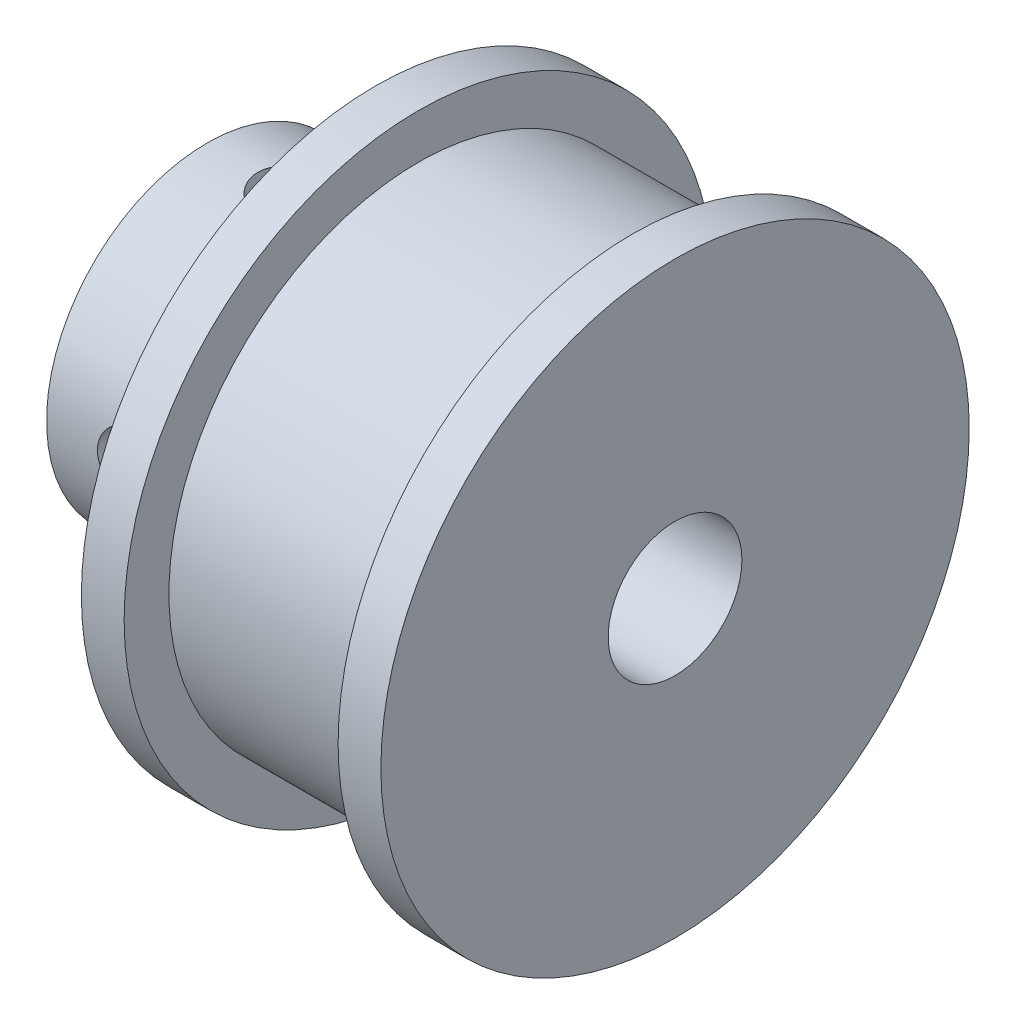
ISO-10303-21;
HEADER;
FILE_DESCRIPTION(('STEP AP214'),'2;1');
FILE_NAME('part.step','',(''),(''),'','','');
FILE_SCHEMA(('AUTOMOTIVE_DESIGN { 1 0 10303 214 1 1 1 1 }'));
ENDSEC;
DATA;
#1=APPLICATION_CONTEXT('core data for automotive mechanical design processes');
#2=APPLICATION_PROTOCOL_DEFINITION('international standard','automotive_design',2000,#1);
#3=PRODUCT_CONTEXT('',#1,'mechanical');
#4=PRODUCT('Part','Part','',(#3));
#5=PRODUCT_RELATED_PRODUCT_CATEGORY('part','',(#4));
#6=PRODUCT_DEFINITION_FORMATION('','',#4);
#7=PRODUCT_DEFINITION_CONTEXT('part definition',#1,'design');
#8=PRODUCT_DEFINITION('design','',#6,#7);
#9=PRODUCT_DEFINITION_SHAPE('','',#8);
#10=(LENGTH_UNIT() NAMED_UNIT(*) SI_UNIT(.MILLI.,.METRE.));
#11=(NAMED_UNIT(*) PLANE_ANGLE_UNIT() SI_UNIT($,.RADIAN.));
#12=(NAMED_UNIT(*) SI_UNIT($,.STERADIAN.) SOLID_ANGLE_UNIT());
#13=UNCERTAINTY_MEASURE_WITH_UNIT(LENGTH_MEASURE(1.E-05),#10,'distance_accuracy_value','');
#14=(GEOMETRIC_REPRESENTATION_CONTEXT(3) GLOBAL_UNCERTAINTY_ASSIGNED_CONTEXT((#13)) GLOBAL_UNIT_ASSIGNED_CONTEXT((#10,
#11,#12)) REPRESENTATION_CONTEXT('',''));
#15=CARTESIAN_POINT('',(0.,0.,0.));
#16=DIRECTION('',(0.,0.,1.));
#17=DIRECTION('',(1.,0.,0.));
#18=AXIS2_PLACEMENT_3D('',#15,#16,#17);
#19=CARTESIAN_POINT('',(0.,0.,0.));
#20=DIRECTION('',(1.,0.,0.));
#21=DIRECTION('',(0.,0.,-1.));
#22=AXIS2_PLACEMENT_3D('',#19,#20,#21);
#23=CYLINDRICAL_SURFACE('',#22,2.5);
#24=CARTESIAN_POINT('',(1.90000000000001,0.,2.5));
#25=CARTESIAN_POINT('',(1.90000412789938,0.0657149536912328,2.49999641755189));
#26=CARTESIAN_POINT('',(1.9052125914021,0.13150824962254,2.49738113774397));
#27=CARTESIAN_POINT('',(1.92581610042616,0.26115029408553,2.48717695046745));
#28=CARTESIAN_POINT('',(1.94123049124707,0.324995108391878,2.4795785978623));
#29=CARTESIAN_POINT('',(1.981492260771,0.448666931100716,2.4602034925414));
#30=CARTESIAN_POINT('',(2.00630298031002,0.508508503673972,2.448442989719));
#31=CARTESIAN_POINT('',(2.06446327670618,0.623090771008203,2.42182220644723));
#32=CARTESIAN_POINT('',(2.09781218031107,0.677831867487559,2.40696217041913));
#33=CARTESIAN_POINT('',(2.17439656185663,0.784384772202395,2.37445322822571));
#34=CARTESIAN_POINT('',(2.21810809904956,0.835819013902635,2.3566899890942));
#35=CARTESIAN_POINT('',(2.3131518490588,0.930974306083717,2.32074962808431));
#36=CARTESIAN_POINT('',(2.36448981471556,0.974689478883453,2.30257220261294));
#37=CARTESIAN_POINT('',(2.47810418690423,1.05656500056284,2.26623688996684));
#38=CARTESIAN_POINT('',(2.5409201229324,1.09403166943954,2.24818983712665));
#39=CARTESIAN_POINT('',(2.67295916998277,1.15771028361336,2.21607473465401));
#40=CARTESIAN_POINT('',(2.74217766090344,1.18393026870791,2.20200384508737));
#41=CARTESIAN_POINT('',(2.88083138177741,1.22266555273573,2.18072333797261));
#42=CARTESIAN_POINT('',(2.95000556508425,1.23590732135054,2.17315339479642));
#43=CARTESIAN_POINT('',(3.08997354722435,1.25053374163605,2.1647736243566));
#44=CARTESIAN_POINT('',(3.16076567608894,1.25193011046634,2.16395711679111));
#45=CARTESIAN_POINT('',(3.29285753039421,1.24335910896536,2.16888662821561));
#46=CARTESIAN_POINT('',(3.35428003902881,1.23473069942102,2.17385954577517));
#47=CARTESIAN_POINT('',(3.4746523867163,1.20867481132116,2.18845285917313));
#48=CARTESIAN_POINT('',(3.53360143163164,1.19124452987206,2.19807473539721));
#49=CARTESIAN_POINT('',(3.64903641570707,1.1477622254825,2.22109345515927));
#50=CARTESIAN_POINT('',(3.70543299848223,1.12151883389499,2.23457300829999));
#51=CARTESIAN_POINT('',(3.81329286573751,1.061302109585,2.26379255351755));
#52=CARTESIAN_POINT('',(3.86475391950011,1.02732530476558,2.27953355975239));
#53=CARTESIAN_POINT('',(3.96815156592903,0.947582568640978,2.31391447379108));
#54=CARTESIAN_POINT('',(4.01932109197019,0.900868072961595,2.33266887795933));
#55=CARTESIAN_POINT('',(4.11341927323862,0.799444473426711,2.36934529125509));
#56=CARTESIAN_POINT('',(4.15634399004235,0.744731570717851,2.38726689948501));
#57=CARTESIAN_POINT('',(4.23460707628715,0.625645632289805,2.42127484103705));
#58=CARTESIAN_POINT('',(4.26950059055717,0.560941989499256,2.43723730202509));
#59=CARTESIAN_POINT('',(4.32762128630376,0.425582769360992,2.46447351401553));
#60=CARTESIAN_POINT('',(4.35085773126895,0.354931970331592,2.47575098679441));
#61=CARTESIAN_POINT('',(4.38309425464584,0.215958114575874,2.49155417176795));
#62=CARTESIAN_POINT('',(4.39311404468347,0.147926913185403,2.4965617287664));
#63=CARTESIAN_POINT('',(4.40183091391811,0.0109744999366904,2.50091266823877));
#64=CARTESIAN_POINT('',(4.40053335704934,-0.0579462748373779,2.5002587340164));
#65=CARTESIAN_POINT('',(4.38724163947655,-0.189041214982493,2.49363990316801));
#66=CARTESIAN_POINT('',(4.37608433408746,-0.251324260062443,2.48809057110237));
#67=CARTESIAN_POINT('',(4.34470241013114,-0.373008615377396,2.47277714143524));
#68=CARTESIAN_POINT('',(4.32447679193329,-0.432409607113745,2.46301257917916));
#69=CARTESIAN_POINT('',(4.27500191695853,-0.54861076056208,2.43980314267087));
#70=CARTESIAN_POINT('',(4.24551118735398,-0.60528799625769,2.42626102212424));
#71=CARTESIAN_POINT('',(4.17861558044244,-0.713076702123649,2.39679967896386));
#72=CARTESIAN_POINT('',(4.1412073317582,-0.7641857872191,2.38087944457232));
#73=CARTESIAN_POINT('',(4.0552994683339,-0.864709611613313,2.34635276671831));
#74=CARTESIAN_POINT('',(4.00607141443304,-0.913465097280795,2.32763606060552));
#75=CARTESIAN_POINT('',(3.90009356091336,-1.00232040139155,2.29077989504843));
#76=CARTESIAN_POINT('',(3.84333860147953,-1.04241423211355,2.27264084226908));
#77=CARTESIAN_POINT('',(3.72044543224961,-1.11463489312211,2.23813990282585));
#78=CARTESIAN_POINT('',(3.65398591723925,-1.14628186984829,2.2219066207934));
#79=CARTESIAN_POINT('',(3.51561241538434,-1.19760353251725,2.19467590460158));
#80=CARTESIAN_POINT('',(3.44370559187351,-1.21729364485946,2.18367172800773));
#81=CARTESIAN_POINT('',(3.30386222142319,-1.24232710931209,2.16951876260834));
#82=CARTESIAN_POINT('',(3.2362071832137,-1.24886624550107,2.16571729325615));
#83=CARTESIAN_POINT('',(3.10069116603659,-1.25086144297598,2.16456693307719));
#84=CARTESIAN_POINT('',(3.03283028907571,-1.24632230828049,2.16721524534441));
#85=CARTESIAN_POINT('',(2.90564562308498,-1.22740765699032,2.17797327562531));
#86=CARTESIAN_POINT('',(2.8461244123195,-1.21401039292849,2.18553868102993));
#87=CARTESIAN_POINT('',(2.73023985071912,-1.1789691977808,2.20463770234897));
#88=CARTESIAN_POINT('',(2.67387752238504,-1.15732261394975,2.21617259462095));
#89=CARTESIAN_POINT('',(2.56171893626674,-1.10476968162585,2.24285662955661));
#90=CARTESIAN_POINT('',(2.50621512271288,-1.07333892227056,2.25819652995239));
#91=CARTESIAN_POINT('',(2.40090682977427,-1.00268871454578,2.29044164543238));
#92=CARTESIAN_POINT('',(2.35110533685189,-0.963465214048302,2.30734767243153));
#93=CARTESIAN_POINT('',(2.25232252205298,-0.872754158330794,2.34327903949142));
#94=CARTESIAN_POINT('',(2.2041761220476,-0.820355528762706,2.36231229139336));
#95=CARTESIAN_POINT('',(2.11717127072046,-0.707693507775342,2.3984719031886));
#96=CARTESIAN_POINT('',(2.07831782571714,-0.647425904070974,2.4155972326005));
#97=CARTESIAN_POINT('',(2.01095454654725,-0.519914496024927,2.44622511981379));
#98=CARTESIAN_POINT('',(1.98251978823571,-0.452624379918261,2.45970120703636));
#99=CARTESIAN_POINT('',(1.93773979010132,-0.313427626617733,2.48126676704332));
#100=CARTESIAN_POINT('',(1.92136019146304,-0.241534749528952,2.48937154216165));
#101=CARTESIAN_POINT('',(1.9076282361552,-0.140752433104225,2.49619327387079));
#102=CARTESIAN_POINT('',(1.90477169892048,-0.112702349299369,2.49761706674002));
#103=CARTESIAN_POINT('',(1.900956668104,-0.0564396647589448,2.49952121222331));
#104=CARTESIAN_POINT('',(1.89999822691101,-0.0282270595592256,2.50000153879704));
#105=CARTESIAN_POINT('',(1.90000000000001,0.,2.5));
#106=B_SPLINE_CURVE_WITH_KNOTS('',3,(#24,#25,#26,#27,#28,#29,#30,#31,#32,#33,#34,#35,#36,#37,
#38,#39,#40,#41,#42,#43,#44,#45,#46,#47,#48,#49,#50,#51,#52,#53,#54,#55,#56,#57,#58,#59,#60,#61,
#62,#63,#64,#65,#66,#67,#68,#69,#70,#71,#72,#73,#74,#75,#76,#77,#78,#79,#80,#81,#82,#83,#84,#85,
#86,#87,#88,#89,#90,#91,#92,#93,#94,#95,#96,#97,#98,#99,#100,#101,#102,#103,#104,#105),
.UNSPECIFIED.,.T.,.F.,(4,2,2,2,2,2,2,2,2,2,2,2,2,2,2,2,2,2,2,2,2,2,2,2,2,2,2,2,2,2,2,2,2,2,2,2,
2,2,2,2,4),(0.,0.197030321775365,0.394435187136495,0.59107769436537,0.787704700726955,
0.996227198397605,1.20490779706754,1.4297715803844,1.6544743487285,1.86572515175286,
2.07676696661274,2.26257140511649,2.44843504907097,2.63862800210608,2.82890651575276,
3.04331176667346,3.25781918248356,3.48228777768049,3.70657771140347,3.9122911308918,
4.11790705639343,4.3075863313265,4.49728652038662,4.6924107003487,4.88761813435421,
5.10199513305521,5.31651985769287,5.54143352699589,5.76605639925969,5.96911634372963,
6.17208824825003,6.35572412805224,6.53941910979594,6.73545570969514,6.93159451423693,
7.15156553440619,7.37165479220712,7.59330017078652,7.81431135781158,7.89894100172117,
7.98357298143554),.UNSPECIFIED.);
#107=CARTESIAN_POINT('',(1.90000000000001,0.,2.5));
#108=VERTEX_POINT('',#107);
#109=EDGE_CURVE('E3265',#108,#108,#106,.T.);
#110=ORIENTED_EDGE('',*,*,#109,.F.);
#111=EDGE_LOOP('',(#110));
#112=FACE_BOUND('',#111,.T.);
#113=CARTESIAN_POINT('',(3.15,2.1650635094611,-1.25));
#114=CARTESIAN_POINT('',(3.21513476024406,2.16506918410574,-1.24999545384316));
#115=CARTESIAN_POINT('',(3.28035176440631,2.16804751484696,-1.24487496341652));
#116=CARTESIAN_POINT('',(3.40878408084644,2.17952958065066,-1.22465401237257));
#117=CARTESIAN_POINT('',(3.47199489380426,2.18804492569449,-1.20953258069272));
#118=CARTESIAN_POINT('',(3.59431458042993,2.20936683256748,-1.17012493587476));
#119=CARTESIAN_POINT('',(3.65344331559198,2.22215054341565,-1.14588744061716));
#120=CARTESIAN_POINT('',(3.7667802524959,2.25053331021072,-1.08908440672046));
#121=CARTESIAN_POINT('',(3.82098818782807,2.26613251845081,-1.05651841754472));
#122=CARTESIAN_POINT('',(3.92788216069688,2.29996086321802,-0.980833175663597));
#123=CARTESIAN_POINT('',(3.98007391959193,2.31830079547442,-0.937065045179712));
#124=CARTESIAN_POINT('',(4.07676048550839,2.35464978482132,-0.841567259518084));
#125=CARTESIAN_POINT('',(4.1212514532294,2.37265867289062,-0.789833657227865));
#126=CARTESIAN_POINT('',(4.20420893893458,2.40776846191186,-0.675611954268182));
#127=CARTESIAN_POINT('',(4.24206720982441,2.42472633022716,-0.612633986265718));
#128=CARTESIAN_POINT('',(4.3064260665572,2.45438445124411,-0.480196283249379));
#129=CARTESIAN_POINT('',(4.33293382017146,2.46708738979677,-0.410740672672693));
#130=CARTESIAN_POINT('',(4.37188082662637,2.48600576555297,-0.272556179907471));
#131=CARTESIAN_POINT('',(4.38518690794442,2.49261850276115,-0.204127238111022));
#132=CARTESIAN_POINT('',(4.4002076483438,2.50009479807584,-0.0657132858723104));
#133=CARTESIAN_POINT('',(4.40192932099464,2.50096183480737,0.00427075730467285));
#134=CARTESIAN_POINT('',(4.39406665753706,2.49703727395563,0.137290655529687));
#135=CARTESIAN_POINT('',(4.38545248059847,2.49273119865201,0.200401498970989));
#136=CARTESIAN_POINT('',(4.35889894511918,2.47967806574684,0.324142214897902));
#137=CARTESIAN_POINT('',(4.34095888877972,2.47093067582992,0.384771901367406));
#138=CARTESIAN_POINT('',(4.29614679238773,2.44964479109568,0.502886739461941));
#139=CARTESIAN_POINT('',(4.26915460853492,2.43705551911499,0.560316779393972));
#140=CARTESIAN_POINT('',(4.20717072974813,2.40922057483359,0.66997100189166));
#141=CARTESIAN_POINT('',(4.17217617087206,2.39397395196855,0.722193311048306));
#142=CARTESIAN_POINT('',(4.09138081058373,2.36055492999037,0.825217076122743));
#143=CARTESIAN_POINT('',(4.04487121459249,2.34224219997719,0.8754175937867));
#144=CARTESIAN_POINT('',(3.94426284383728,2.30567925733515,0.967630462872224));
#145=CARTESIAN_POINT('',(3.89015828465742,2.28742910332036,1.00963651446779));
#146=CARTESIAN_POINT('',(3.77168975946989,2.25180195115606,1.08688166830276));
#147=CARTESIAN_POINT('',(3.70689247118224,2.23455399988385,1.12152164372256));
#148=CARTESIAN_POINT('',(3.57132791080125,2.2046931284822,1.17914889125154));
#149=CARTESIAN_POINT('',(3.50056695872805,2.19207537557584,1.20214832276361));
#150=CARTESIAN_POINT('',(3.36098186089651,2.17430794771293,1.2339752637813));
#151=CARTESIAN_POINT('',(3.29244860119556,2.16864569810621,1.24378140264997));
#152=CARTESIAN_POINT('',(3.15449832310432,2.16397399202012,1.25189618326428));
#153=CARTESIAN_POINT('',(3.08508196360027,2.1649598361164,1.25021294664378));
#154=CARTESIAN_POINT('',(2.95543260177659,2.17292920675731,1.23629505417996));
#155=CARTESIAN_POINT('',(2.89502568611509,2.17924484383318,1.22523477089058));
#156=CARTESIAN_POINT('',(2.7770402671613,2.19617526939177,1.19462035579055));
#157=CARTESIAN_POINT('',(2.71946268656674,2.20679145006292,1.17506347327952));
#158=CARTESIAN_POINT('',(2.60573583637163,2.23170277599571,1.12705948575611));
#159=CARTESIAN_POINT('',(2.54977622893306,2.24614554053829,1.0982425796159));
#160=CARTESIAN_POINT('',(2.44316341057626,2.27695149371562,1.03285883001975));
#161=CARTESIAN_POINT('',(2.3925129456084,2.29331566693935,0.996288005415269));
#162=CARTESIAN_POINT('',(2.29127654059557,2.3285999807042,0.911046458998566));
#163=CARTESIAN_POINT('',(2.24150356160293,2.34758228942861,0.861431590393707));
#164=CARTESIAN_POINT('',(2.15073470250801,2.38417793722366,0.754255619247859));
#165=CARTESIAN_POINT('',(2.10974178721183,2.40179081259637,0.696691843319182));
#166=CARTESIAN_POINT('',(2.03678284256238,2.43426702113696,0.573169203198445));
#167=CARTESIAN_POINT('',(2.00508360223636,2.44904552090037,0.50702887196764));
#168=CARTESIAN_POINT('',(1.95357762017826,2.47354193699126,0.369402955801352));
#169=CARTESIAN_POINT('',(1.93376043579212,2.48326429595466,0.297922126740219));
#170=CARTESIAN_POINT('',(1.90828929478168,2.49584385227353,0.158724602913021));
#171=CARTESIAN_POINT('',(1.90150265515486,2.49924909885239,0.0912643048130704));
#172=CARTESIAN_POINT('',(1.898945918182,2.50052662968914,-0.0439074824390051));
#173=CARTESIAN_POINT('',(1.90317196434555,2.49840085083612,-0.111618875368859));
#174=CARTESIAN_POINT('',(1.92177050849453,2.48917461047403,-0.240672490396434));
#175=CARTESIAN_POINT('',(1.93545606157209,2.48241118334987,-0.30214039726408));
#176=CARTESIAN_POINT('',(1.97165874912872,2.46490117079279,-0.421807440229522));
#177=CARTESIAN_POINT('',(1.99417715011682,2.45415401415995,-0.480006106194386));
#178=CARTESIAN_POINT('',(2.04840881520747,2.4290741343515,-0.594279257806106));
#179=CARTESIAN_POINT('',(2.0804741540098,2.41460771498499,-0.650156428375058));
#180=CARTESIAN_POINT('',(2.15244741357382,2.38360166427283,-0.755968302267531));
#181=CARTESIAN_POINT('',(2.19235893639459,2.36706108197951,-0.805900259268634));
#182=CARTESIAN_POINT('',(2.28349642377838,2.33160762783285,-0.903642505196113));
#183=CARTESIAN_POINT('',(2.33545310934649,2.31262248764622,-0.950747105674089));
#184=CARTESIAN_POINT('',(2.44681340141222,2.27578845203566,-1.03582910924334));
#185=CARTESIAN_POINT('',(2.50622352608461,2.25794057202332,-1.07379843751257));
#186=CARTESIAN_POINT('',(2.6332958082262,2.22499506631145,-1.14053884973207));
#187=CARTESIAN_POINT('',(2.70115941391092,2.21000217820338,-1.16898133245117));
#188=CARTESIAN_POINT('',(2.84166550542472,2.1858269541044,-1.21359838688301));
#189=CARTESIAN_POINT('',(2.91429111114086,2.17662520184628,-1.22981398896918));
#190=CARTESIAN_POINT('',(3.014756694565,2.16911590752238,-1.24295875983052));
#191=CARTESIAN_POINT('',(3.04170986799736,2.1676016125644,-1.24559513120481));
#192=CARTESIAN_POINT('',(3.09577060085281,2.16557419859688,-1.24911675636245));
#193=CARTESIAN_POINT('',(3.12287817048234,2.16506114656387,-1.25000189299984));
#194=CARTESIAN_POINT('',(3.15,2.1650635094611,-1.25));
#195=B_SPLINE_CURVE_WITH_KNOTS('',3,(#113,#114,#115,#116,#117,#118,#119,#120,#121,#122,#123,
#124,#125,#126,#127,#128,#129,#130,#131,#132,#133,#134,#135,#136,#137,#138,#139,#140,#141,#142,
#143,#144,#145,#146,#147,#148,#149,#150,#151,#152,#153,#154,#155,#156,#157,#158,#159,#160,#161,
#162,#163,#164,#165,#166,#167,#168,#169,#170,#171,#172,#173,#174,#175,#176,#177,#178,#179,#180,
#181,#182,#183,#184,#185,#186,#187,#188,#189,#190,#191,#192,#193,#194),.UNSPECIFIED.,.T.,.F.,(4,
2,2,2,2,2,2,2,2,2,2,2,2,2,2,2,2,2,2,2,2,2,2,2,2,2,2,2,2,2,2,2,2,2,2,2,2,2,2,2,4),(0.,
0.195290153243394,0.390991116031006,0.585660744898607,0.780340906806436,0.991077890622791,
1.20191963855464,1.42697365298454,1.65188533704864,1.86079356209919,2.0695752960755,
2.26020121855673,2.45084140646819,2.64411918413933,2.83746624187839,3.04908989321113,
3.26087560307398,3.4861105216181,3.71110967764631,3.91827863567764,4.12530116485466,
4.30967729280031,4.49411315545078,4.68709120507609,4.88016857775059,5.09758429475766,
5.31507331222752,5.53830226766207,5.76133474760964,5.96390337986858,6.16640108492464,
6.35555531089365,6.54473666890015,6.74200938399339,6.93937287625898,7.15637802312583,
7.37357428556442,7.59763436298255,7.82093916253449,7.90225168981636,7.98356965618175),.UNSPECIFIED.);
#196=CARTESIAN_POINT('',(3.15,2.1650635094611,-1.25));
#197=VERTEX_POINT('',#196);
#198=EDGE_CURVE('E3264',#197,#197,#195,.T.);
#199=ORIENTED_EDGE('',*,*,#198,.F.);
#200=EDGE_LOOP('',(#199));
#201=FACE_BOUND('',#200,.T.);
#202=CARTESIAN_POINT('',(17.5,0.,0.));
#203=DIRECTION('',(1.,0.,0.));
#204=DIRECTION('',(0.,0.,-1.));
#205=AXIS2_PLACEMENT_3D('',#202,#203,#204);
#206=CIRCLE('',#205,2.5);
#207=CARTESIAN_POINT('',(17.5,0.,-2.5));
#208=VERTEX_POINT('',#207);
#209=EDGE_CURVE('E3285',#208,#208,#206,.T.);
#210=ORIENTED_EDGE('',*,*,#209,.T.);
#211=EDGE_LOOP('',(#210));
#212=FACE_BOUND('',#211,.T.);
#213=CARTESIAN_POINT('',(0.,0.,0.));
#214=DIRECTION('',(1.,0.,0.));
#215=DIRECTION('',(0.,0.,-1.));
#216=AXIS2_PLACEMENT_3D('',#213,#214,#215);
#217=CIRCLE('',#216,2.5);
#218=CARTESIAN_POINT('',(0.,0.,-2.5));
#219=VERTEX_POINT('',#218);
#220=EDGE_CURVE('E14',#219,#219,#217,.T.);
#221=ORIENTED_EDGE('',*,*,#220,.F.);
#222=EDGE_LOOP('',(#221));
#223=FACE_BOUND('',#222,.T.);
#224=ADVANCED_FACE('F3239',(#112,#201,#212,#223),#23,.F.);
#225=CARTESIAN_POINT('',(0.,2.5,0.));
#226=DIRECTION('',(-1.,0.,0.));
#227=DIRECTION('',(0.,0.,1.));
#228=AXIS2_PLACEMENT_3D('',#225,#226,#227);
#229=PLANE('',#228);
#230=ORIENTED_EDGE('',*,*,#220,.T.);
#231=EDGE_LOOP('',(#230));
#232=FACE_BOUND('',#231,.T.);
#233=CARTESIAN_POINT('',(0.,0.,0.));
#234=DIRECTION('',(1.,0.,0.));
#235=DIRECTION('',(0.,0.,-1.));
#236=AXIS2_PLACEMENT_3D('',#233,#234,#235);
#237=CIRCLE('',#236,6.);
#238=CARTESIAN_POINT('',(0.,0.,-6.));
#239=VERTEX_POINT('',#238);
#240=EDGE_CURVE('E3251',#239,#239,#237,.T.);
#241=ORIENTED_EDGE('',*,*,#240,.F.);
#242=EDGE_LOOP('',(#241));
#243=FACE_BOUND('',#242,.T.);
#244=ADVANCED_FACE('F3314',(#232,#243),#229,.T.);
#245=CARTESIAN_POINT('',(0.,0.,0.));
#246=DIRECTION('',(1.,0.,0.));
#247=DIRECTION('',(0.,0.,-1.));
#248=AXIS2_PLACEMENT_3D('',#245,#246,#247);
#249=CYLINDRICAL_SURFACE('',#248,6.);
#250=CARTESIAN_POINT('',(1.90000000000001,0.,6.));
#251=CARTESIAN_POINT('',(1.90000247746923,-0.0694090417016603,5.99999871526651));
#252=CARTESIAN_POINT('',(1.90580066571876,-0.138848789520875,5.99878328775043));
#253=CARTESIAN_POINT('',(1.92881934953286,-0.275761316266992,5.99405200990679));
#254=CARTESIAN_POINT('',(1.94604852303694,-0.343232560128311,5.99053441189248));
#255=CARTESIAN_POINT('',(1.99137045492183,-0.474209132291339,5.98159109196202));
#256=CARTESIAN_POINT('',(2.01945239599889,-0.537718336709182,5.97616727052645));
#257=CARTESIAN_POINT('',(2.08564960885619,-0.659120328605954,5.96399927809859));
#258=CARTESIAN_POINT('',(2.12376443115584,-0.717013367534323,5.95725516625975));
#259=CARTESIAN_POINT('',(2.20953634019065,-0.826390324308832,5.9430770002465));
#260=CARTESIAN_POINT('',(2.25731200123509,-0.87778024416268,5.93563505848531));
#261=CARTESIAN_POINT('',(2.36079465919511,-0.971877776769387,5.92095657692448));
#262=CARTESIAN_POINT('',(2.41650231187227,-1.01458467096098,5.91372005416683));
#263=CARTESIAN_POINT('',(2.53495196876616,-1.09051031677216,5.90019442595308));
#264=CARTESIAN_POINT('',(2.59775838450275,-1.1236305468065,5.89391545174828));
#265=CARTESIAN_POINT('',(2.72819745177276,-1.17881119348063,5.8831284065002));
#266=CARTESIAN_POINT('',(2.79582958244254,-1.20087280167641,5.87862014467568));
#267=CARTESIAN_POINT('',(2.93298523741564,-1.23300240133736,5.87196500986123));
#268=CARTESIAN_POINT('',(3.00246835933477,-1.24323597696798,5.86978556855865));
#269=CARTESIAN_POINT('',(3.14219684286263,-1.25193357655614,5.86793690716491));
#270=CARTESIAN_POINT('',(3.2124421188653,-1.25039890894686,5.86826740800981));
#271=CARTESIAN_POINT('',(3.35048102797518,-1.23573719037196,5.87137174319175));
#272=CARTESIAN_POINT('',(3.41829597966121,-1.2228010523272,5.87410533679901));
#273=CARTESIAN_POINT('',(3.55077150964493,-1.18600543529945,5.88164437615942));
#274=CARTESIAN_POINT('',(3.61543192560633,-1.16214539481381,5.88644992841317));
#275=CARTESIAN_POINT('',(3.74030722841598,-1.10400003213928,5.89763191464102));
#276=CARTESIAN_POINT('',(3.80048629652707,-1.06964002534236,5.90401953785586));
#277=CARTESIAN_POINT('',(3.91429574426816,-0.991522699274812,5.91763890010721));
#278=CARTESIAN_POINT('',(3.96792530883597,-0.947764212262582,5.92487074398537));
#279=CARTESIAN_POINT('',(4.06821396108037,-0.851074921546777,5.93953730929909));
#280=CARTESIAN_POINT('',(4.11471616889701,-0.797981433412077,5.94697323199473));
#281=CARTESIAN_POINT('',(4.19818044222897,-0.684667288611794,5.96108088143001));
#282=CARTESIAN_POINT('',(4.23514236459839,-0.624446525025762,5.96775259670236));
#283=CARTESIAN_POINT('',(4.29851008153595,-0.498405541235475,5.97959870942815));
#284=CARTESIAN_POINT('',(4.32489680456711,-0.432575461926497,5.98477039710258));
#285=CARTESIAN_POINT('',(4.36619170483549,-0.297284620972153,5.99301338211281));
#286=CARTESIAN_POINT('',(4.38110139323139,-0.227824338595088,5.99608495596053));
#287=CARTESIAN_POINT('',(4.39879425206788,-0.0885918657008349,5.99974275215455));
#288=CARTESIAN_POINT('',(4.40179194149424,-0.0188480555261788,6.00037293537579));
#289=CARTESIAN_POINT('',(4.39615505003089,0.120143798757714,5.99919952252774));
#290=CARTESIAN_POINT('',(4.3875211813984,0.189391872962257,5.99739607548153));
#291=CARTESIAN_POINT('',(4.35904434653046,0.324726367119811,5.99158564979184));
#292=CARTESIAN_POINT('',(4.33931251461653,0.390837192894204,5.98760052868077));
#293=CARTESIAN_POINT('',(4.28932213957859,0.518811446661328,5.97787227242395));
#294=CARTESIAN_POINT('',(4.25906275913401,0.580674536336772,5.97212899744579));
#295=CARTESIAN_POINT('',(4.18841962176244,0.69929430694349,5.95941241490714));
#296=CARTESIAN_POINT('',(4.14790807043093,0.755973219469829,5.9524239381233));
#297=CARTESIAN_POINT('',(4.05808043692373,0.861805445886515,5.93802568299709));
#298=CARTESIAN_POINT('',(4.00876332448106,0.910957877913281,5.93061585542511));
#299=CARTESIAN_POINT('',(3.9017444230003,1.0011786486518,5.91606024531377));
#300=CARTESIAN_POINT('',(3.84391696804472,1.04209914600204,5.90892089307501));
#301=CARTESIAN_POINT('',(3.72208371578621,1.11364719079243,5.89585601015805));
#302=CARTESIAN_POINT('',(3.65807817586089,1.14427516677863,5.88993042894651));
#303=CARTESIAN_POINT('',(3.52603880370177,1.19417246443921,5.88001700708041));
#304=CARTESIAN_POINT('',(3.45802896283416,1.21350309828031,5.87601872784687));
#305=CARTESIAN_POINT('',(3.31963344950774,1.24044038523407,5.87039184709697));
#306=CARTESIAN_POINT('',(3.24924811838056,1.2480487154444,5.86876290660367));
#307=CARTESIAN_POINT('',(3.10958659900035,1.25125926487611,5.86807907308506));
#308=CARTESIAN_POINT('',(3.04031592977795,1.24709542622725,5.86897402321502));
#309=CARTESIAN_POINT('',(2.90348599107978,1.22739905314031,5.87312447254928));
#310=CARTESIAN_POINT('',(2.8359267051839,1.21186662782265,5.87637994909626));
#311=CARTESIAN_POINT('',(2.70460222810934,1.16998217768584,5.88486132447716));
#312=CARTESIAN_POINT('',(2.64082675351308,1.14366117568421,5.8900815700793));
#313=CARTESIAN_POINT('',(2.51856122397334,1.08097457299757,5.90190705738738));
#314=CARTESIAN_POINT('',(2.46007166036688,1.04460803983029,5.9085124276546));
#315=CARTESIAN_POINT('',(2.34887837292056,0.962073695342405,5.92251579551146));
#316=CARTESIAN_POINT('',(2.29630087543502,0.91573789041822,5.92992613868404));
#317=CARTESIAN_POINT('',(2.19959050677365,0.814924438115329,5.94461839583213));
#318=CARTESIAN_POINT('',(2.15545958244852,0.760444918832963,5.9519002798488));
#319=CARTESIAN_POINT('',(2.07641142681595,0.644134427507699,5.96561444547637));
#320=CARTESIAN_POINT('',(2.04160632011372,0.582225921521345,5.97203596073244));
#321=CARTESIAN_POINT('',(1.98294977156998,0.453319843998451,5.98319908494092));
#322=CARTESIAN_POINT('',(1.95908875281813,0.386326781907242,5.98794216182101));
#323=CARTESIAN_POINT('',(1.92745972171158,0.266015292900104,5.99432499781443));
#324=CARTESIAN_POINT('',(1.91718123679115,0.213367593727928,5.99644035661395));
#325=CARTESIAN_POINT('',(1.90345054572268,0.107152674176536,5.99927832789758));
#326=CARTESIAN_POINT('',(1.89999808733282,0.0535854878488715,6.00000099184586));
#327=CARTESIAN_POINT('',(1.90000000000001,0.,6.));
#328=B_SPLINE_CURVE_WITH_KNOTS('',3,(#250,#251,#252,#253,#254,#255,#256,#257,#258,#259,#260,
#261,#262,#263,#264,#265,#266,#267,#268,#269,#270,#271,#272,#273,#274,#275,#276,#277,#278,#279,
#280,#281,#282,#283,#284,#285,#286,#287,#288,#289,#290,#291,#292,#293,#294,#295,#296,#297,#298,
#299,#300,#301,#302,#303,#304,#305,#306,#307,#308,#309,#310,#311,#312,#313,#314,#315,#316,#317,
#318,#319,#320,#321,#322,#323,#324,#325,#326,#327),.UNSPECIFIED.,.T.,.F.,(4,2,2,2,2,2,2,2,2,2,2,
2,2,2,2,2,2,2,2,2,2,2,2,2,2,2,2,2,2,2,2,2,2,2,2,2,2,2,4),(0.,0.208031045103182,
0.416220199906223,0.624202378825439,0.832175241572985,1.04287526388122,1.25359271551785,
1.46640449178548,1.67919333285489,1.88896575169853,2.09871484767163,2.30501712129058,
2.51133000030278,2.71914592416748,2.92698768368033,3.13889526355464,3.35080602278216,
3.5630972449966,3.77536051045769,3.98378339407673,4.19219351552275,4.39855286632619,
4.60492863390931,4.81401583995734,5.02312752564571,5.23571263829333,5.44828889851306,
5.65970050095022,5.87108185414182,6.07829223291035,6.28550062281358,6.49211731393252,
6.69875319081476,6.90919024830305,7.11967575117366,7.33258864398252,7.54531486464969,
7.70592588477276,7.86653096973387),.UNSPECIFIED.);
#329=CARTESIAN_POINT('',(1.90000000000001,0.,6.));
#330=VERTEX_POINT('',#329);
#331=EDGE_CURVE('E3243',#330,#330,#328,.T.);
#332=ORIENTED_EDGE('',*,*,#331,.F.);
#333=EDGE_LOOP('',(#332));
#334=FACE_BOUND('',#333,.T.);
#335=CARTESIAN_POINT('',(3.15,5.86834729715275,-1.25));
#336=CARTESIAN_POINT('',(3.08060938484897,5.86834869213645,-1.24999750877599));
#337=CARTESIAN_POINT('',(3.01118802798478,5.86959145924544,-1.24420229433948));
#338=CARTESIAN_POINT('',(2.87431368268275,5.87442015581798,-1.22119649233779));
#339=CARTESIAN_POINT('',(2.80686224449358,5.87800788138388,-1.20397715440342));
#340=CARTESIAN_POINT('',(2.67592762716513,5.8871029296193,-1.1586839750723));
#341=CARTESIAN_POINT('',(2.6124404040082,5.89260825706945,-1.13062141248932));
#342=CARTESIAN_POINT('',(2.4910755003544,5.90491581335741,-1.06446988601732));
#343=CARTESIAN_POINT('',(2.43319759326998,5.91171798977622,-1.0263813273582));
#344=CARTESIAN_POINT('',(2.32380462484654,5.92596934661468,-0.940636399466082));
#345=CARTESIAN_POINT('',(2.27238810637353,5.93342614373039,-0.892855554869668));
#346=CARTESIAN_POINT('',(2.1782389313519,5.94807966802575,-0.789351223880636));
#347=CARTESIAN_POINT('',(2.13550691170856,5.95527637609915,-0.733627155456002));
#348=CARTESIAN_POINT('',(2.05955411191714,5.96868135118848,-0.615162052999588));
#349=CARTESIAN_POINT('',(2.02642747353674,5.97487958631242,-0.552359428204941));
#350=CARTESIAN_POINT('',(1.97123394714022,5.98550347343302,-0.421928551006719));
#351=CARTESIAN_POINT('',(1.94916593484647,5.98992930561222,-0.354300789950591));
#352=CARTESIAN_POINT('',(1.91702423888253,5.99645589892179,-0.217162904200502));
#353=CARTESIAN_POINT('',(1.90678398280484,5.99858891959926,-0.147693380916357));
#354=CARTESIAN_POINT('',(1.89806830424298,6.00040112580612,-0.00799184883952432));
#355=CARTESIAN_POINT('',(1.8995916558069,6.0000805670369,0.0622400797368385));
#356=CARTESIAN_POINT('',(1.91423460095674,5.99704658090511,0.200326586199572));
#357=CARTESIAN_POINT('',(1.92717471895812,5.99437018956584,0.268201128726475));
#358=CARTESIAN_POINT('',(1.96399862533131,5.98696720898885,0.400793746289752));
#359=CARTESIAN_POINT('',(1.98788287720308,5.98224053291904,0.465511687511022));
#360=CARTESIAN_POINT('',(2.0460800521255,5.97120767323924,0.590460005384683));
#361=CARTESIAN_POINT('',(2.08046229420966,5.96489104125346,0.65065713498165));
#362=CARTESIAN_POINT('',(2.15862800284042,5.95137300440189,0.764493456510647));
#363=CARTESIAN_POINT('',(2.20241263820613,5.94417148958325,0.818131831816418));
#364=CARTESIAN_POINT('',(2.29912162489106,5.92951700233276,0.918394203276912));
#365=CARTESIAN_POINT('',(2.35220305998195,5.92206184975925,0.964866487494794));
#366=CARTESIAN_POINT('',(2.4654820489948,5.90786872648996,1.04827597240488));
#367=CARTESIAN_POINT('',(2.52567976138724,5.9011307717716,1.0852129606998));
#368=CARTESIAN_POINT('',(2.6517122548288,5.88912998409156,1.14856217138454));
#369=CARTESIAN_POINT('',(2.71756065069343,5.88387085232125,1.17494805489727));
#370=CARTESIAN_POINT('',(2.85289161936939,5.8754760641036,1.21623577538673));
#371=CARTESIAN_POINT('',(2.92237367280809,5.87234010507182,1.23113924882349));
#372=CARTESIAN_POINT('',(3.06161970631891,5.86860783239132,1.24880863867017));
#373=CARTESIAN_POINT('',(3.13135458453703,5.86796551863474,1.25179442917998));
#374=CARTESIAN_POINT('',(3.27032581154014,5.86916952018704,1.24613693439294));
#375=CARTESIAN_POINT('',(3.33956219090234,5.87101568152623,1.23749436857863));
#376=CARTESIAN_POINT('',(3.47482051605812,5.87694538226166,1.20901558325484));
#377=CARTESIAN_POINT('',(3.54086866717883,5.88100511282998,1.18929841376871));
#378=CARTESIAN_POINT('',(3.6687239894416,5.8908833850312,1.13935810860919));
#379=CARTESIAN_POINT('',(3.7305307856504,5.89670208191057,1.10913404556146));
#380=CARTESIAN_POINT('',(3.84910644121623,5.90954501937191,1.03854598181485));
#381=CARTESIAN_POINT('',(3.90579220446617,5.91658506648323,0.998045327353962));
#382=CARTESIAN_POINT('',(4.01164324915506,5.93103483993908,0.908234440569878));
#383=CARTESIAN_POINT('',(4.06080768623923,5.93844460766532,0.858923220505172));
#384=CARTESIAN_POINT('',(4.15106271309716,5.95294924316736,0.751900450843339));
#385=CARTESIAN_POINT('',(4.19200409502638,5.9600367471991,0.694061907614551));
#386=CARTESIAN_POINT('',(4.26358875208798,5.97296708772407,0.57220010221636));
#387=CARTESIAN_POINT('',(4.29423248223745,5.97880997920818,0.508177113476881));
#388=CARTESIAN_POINT('',(4.34413867931735,5.98856148270679,0.376142117847919));
#389=CARTESIAN_POINT('',(4.36346916554434,5.99248163136497,0.308156710970195));
#390=CARTESIAN_POINT('',(4.3904144040081,5.99799561410226,0.169813400503473));
#391=CARTESIAN_POINT('',(4.39803069353274,5.99958975342889,0.0994558094616958));
#392=CARTESIAN_POINT('',(4.40126762204851,6.00026408056941,-0.0402133434703387));
#393=CARTESIAN_POINT('',(4.39711189999473,5.99939113754811,-0.109519592177922));
#394=CARTESIAN_POINT('',(4.37741936134707,5.99532874094472,-0.246422870373552));
#395=CARTESIAN_POINT('',(4.36188271359323,5.99213932172839,-0.314019925202702));
#396=CARTESIAN_POINT('',(4.31997220535144,5.98380460077544,-0.445431965492052));
#397=CARTESIAN_POINT('',(4.29362733614689,5.97866453407556,-0.509256550004524));
#398=CARTESIAN_POINT('',(4.230877602268,5.96697995347704,-0.631610567220741));
#399=CARTESIAN_POINT('',(4.19447186165686,5.96043531730246,-0.690139538279511));
#400=CARTESIAN_POINT('',(4.11189033200669,5.94651596786386,-0.80134032129826));
#401=CARTESIAN_POINT('',(4.0655557119433,5.93912880302851,-0.853892633615926));
#402=CARTESIAN_POINT('',(3.96475549900292,5.9244278681135,-0.950552741980385));
#403=CARTESIAN_POINT('',(3.91028797005157,5.91711411595368,-0.994658521571232));
#404=CARTESIAN_POINT('',(3.79399089756656,5.90329191643327,-1.07367451852767));
#405=CARTESIAN_POINT('',(3.73208158853791,5.89679406702551,-1.10846928126994));
#406=CARTESIAN_POINT('',(3.60317484391674,5.88547039658063,-1.16710627925306));
#407=CARTESIAN_POINT('',(3.53618195154699,5.88064310352601,-1.1909581629246));
#408=CARTESIAN_POINT('',(3.41589371843157,5.87414004405196,-1.22256554131861));
#409=CARTESIAN_POINT('',(3.36327046340695,5.87198163591589,-1.2328344900567));
#410=CARTESIAN_POINT('',(3.25710421947899,5.86908475266778,-1.24655254358404));
#411=CARTESIAN_POINT('',(3.20356126768996,5.86834622039193,-1.25000192292741));
#412=CARTESIAN_POINT('',(3.15,5.86834729715275,-1.25));
#413=B_SPLINE_CURVE_WITH_KNOTS('',3,(#335,#336,#337,#338,#339,#340,#341,#342,#343,#344,#345,
#346,#347,#348,#349,#350,#351,#352,#353,#354,#355,#356,#357,#358,#359,#360,#361,#362,#363,#364,
#365,#366,#367,#368,#369,#370,#371,#372,#373,#374,#375,#376,#377,#378,#379,#380,#381,#382,#383,
#384,#385,#386,#387,#388,#389,#390,#391,#392,#393,#394,#395,#396,#397,#398,#399,#400,#401,#402,
#403,#404,#405,#406,#407,#408,#409,#410,#411,#412),.UNSPECIFIED.,.T.,.F.,(4,2,2,2,2,2,2,2,2,2,2,
2,2,2,2,2,2,2,2,2,2,2,2,2,2,2,2,2,2,2,2,2,2,2,2,2,2,2,4),(0.,0.207975654071269,0.41611079241747,
0.624030014802729,0.831940834815791,1.04271333467885,1.25350128663874,1.46629026266844,
1.67905760106933,1.88879048859264,2.09850151896339,2.30497341416461,2.5114540545587,
2.71932871977949,2.9272292410426,3.13905862244913,3.35089272191628,3.56325237332487,
3.77558175387597,3.98397516009792,4.19235567296524,4.39853786231922,4.60473825464031,
4.81383917934651,5.02296356082185,5.23559458753343,5.4482162175904,5.65954599648534,
5.87084803959581,6.07816293922644,6.28547476332981,6.492234105851,6.69901145528173,
6.90938318978573,7.11980508427535,7.33272651358123,7.54545984571988,7.70599867585769,
7.8665310426116),.UNSPECIFIED.);
#414=CARTESIAN_POINT('',(3.15,5.86834729715275,-1.25));
#415=VERTEX_POINT('',#414);
#416=EDGE_CURVE('E3259',#415,#415,#413,.T.);
#417=ORIENTED_EDGE('',*,*,#416,.F.);
#418=EDGE_LOOP('',(#417));
#419=FACE_BOUND('',#418,.T.);
#420=ORIENTED_EDGE('',*,*,#240,.T.);
#421=EDGE_LOOP('',(#420));
#422=FACE_BOUND('',#421,.T.);
#423=CARTESIAN_POINT('',(6.3,0.,0.));
#424=DIRECTION('',(1.,0.,0.));
#425=DIRECTION('',(0.,0.,-1.));
#426=AXIS2_PLACEMENT_3D('',#423,#424,#425);
#427=CIRCLE('',#426,6.);
#428=CARTESIAN_POINT('',(6.3,0.,-6.));
#429=VERTEX_POINT('',#428);
#430=EDGE_CURVE('E3256',#429,#429,#427,.T.);
#431=ORIENTED_EDGE('',*,*,#430,.F.);
#432=EDGE_LOOP('',(#431));
#433=FACE_BOUND('',#432,.T.);
#434=ADVANCED_FACE('F3266',(#334,#419,#422,#433),#249,.T.);
#435=CARTESIAN_POINT('',(6.3,11.,0.));
#436=DIRECTION('',(-1.,0.,0.));
#437=DIRECTION('',(0.,0.,1.));
#438=AXIS2_PLACEMENT_3D('',#435,#436,#437);
#439=PLANE('',#438);
#440=ORIENTED_EDGE('',*,*,#430,.T.);
#441=EDGE_LOOP('',(#440));
#442=FACE_BOUND('',#441,.T.);
#443=CARTESIAN_POINT('',(6.3,0.,0.));
#444=DIRECTION('',(1.,0.,0.));
#445=DIRECTION('',(0.,0.,-1.));
#446=AXIS2_PLACEMENT_3D('',#443,#444,#445);
#447=CIRCLE('',#446,11.);
#448=CARTESIAN_POINT('',(6.3,0.,-11.));
#449=VERTEX_POINT('',#448);
#450=EDGE_CURVE('E3305',#449,#449,#447,.T.);
#451=ORIENTED_EDGE('',*,*,#450,.F.);
#452=EDGE_LOOP('',(#451));
#453=FACE_BOUND('',#452,.T.);
#454=ADVANCED_FACE('F3310',(#442,#453),#439,.T.);
#455=CARTESIAN_POINT('',(0.,0.,0.));
#456=DIRECTION('',(1.,0.,0.));
#457=DIRECTION('',(0.,0.,-1.));
#458=AXIS2_PLACEMENT_3D('',#455,#456,#457);
#459=CYLINDRICAL_SURFACE('',#458,11.);
#460=ORIENTED_EDGE('',*,*,#450,.T.);
#461=EDGE_LOOP('',(#460));
#462=FACE_BOUND('',#461,.T.);
#463=CARTESIAN_POINT('',(7.9,0.,0.));
#464=DIRECTION('',(1.,0.,0.));
#465=DIRECTION('',(0.,0.,-1.));
#466=AXIS2_PLACEMENT_3D('',#463,#464,#465);
#467=CIRCLE('',#466,11.);
#468=CARTESIAN_POINT('',(7.9,0.,-11.));
#469=VERTEX_POINT('',#468);
#470=EDGE_CURVE('E3302',#469,#469,#467,.T.);
#471=ORIENTED_EDGE('',*,*,#470,.F.);
#472=EDGE_LOOP('',(#471));
#473=FACE_BOUND('',#472,.T.);
#474=ADVANCED_FACE('F3320',(#462,#473),#459,.T.);
#475=CARTESIAN_POINT('',(7.9,11.,0.));
#476=DIRECTION('',(1.,0.,0.));
#477=DIRECTION('',(0.,0.,-1.));
#478=AXIS2_PLACEMENT_3D('',#475,#476,#477);
#479=PLANE('',#478);
#480=ORIENTED_EDGE('',*,*,#470,.T.);
#481=EDGE_LOOP('',(#480));
#482=FACE_BOUND('',#481,.T.);
#483=CARTESIAN_POINT('',(7.9,0.,0.));
#484=DIRECTION('',(1.,0.,0.));
#485=DIRECTION('',(0.,0.,-1.));
#486=AXIS2_PLACEMENT_3D('',#483,#484,#485);
#487=CIRCLE('',#486,9.325);
#488=CARTESIAN_POINT('',(7.9,0.,-9.325));
#489=VERTEX_POINT('',#488);
#490=EDGE_CURVE('E3299',#489,#489,#487,.T.);
#491=ORIENTED_EDGE('',*,*,#490,.F.);
#492=EDGE_LOOP('',(#491));
#493=FACE_BOUND('',#492,.T.);
#494=ADVANCED_FACE('F3354',(#482,#493),#479,.T.);
#495=CARTESIAN_POINT('',(0.,0.,0.));
#496=DIRECTION('',(1.,0.,0.));
#497=DIRECTION('',(0.,0.,-1.));
#498=AXIS2_PLACEMENT_3D('',#495,#496,#497);
#499=CYLINDRICAL_SURFACE('',#498,9.325);
#500=ORIENTED_EDGE('',*,*,#490,.T.);
#501=EDGE_LOOP('',(#500));
#502=FACE_BOUND('',#501,.T.);
#503=CARTESIAN_POINT('',(15.9,0.,0.));
#504=DIRECTION('',(1.,0.,0.));
#505=DIRECTION('',(0.,0.,-1.));
#506=AXIS2_PLACEMENT_3D('',#503,#504,#505);
#507=CIRCLE('',#506,9.325);
#508=CARTESIAN_POINT('',(15.9,0.,-9.325));
#509=VERTEX_POINT('',#508);
#510=EDGE_CURVE('E3296',#509,#509,#507,.T.);
#511=ORIENTED_EDGE('',*,*,#510,.F.);
#512=EDGE_LOOP('',(#511));
#513=FACE_BOUND('',#512,.T.);
#514=ADVANCED_FACE('F3348',(#502,#513),#499,.T.);
#515=CARTESIAN_POINT('',(15.9,9.325,0.));
#516=DIRECTION('',(-1.,0.,0.));
#517=DIRECTION('',(0.,0.,1.));
#518=AXIS2_PLACEMENT_3D('',#515,#516,#517);
#519=PLANE('',#518);
#520=ORIENTED_EDGE('',*,*,#510,.T.);
#521=EDGE_LOOP('',(#520));
#522=FACE_BOUND('',#521,.T.);
#523=CARTESIAN_POINT('',(15.9,0.,0.));
#524=DIRECTION('',(1.,0.,0.));
#525=DIRECTION('',(0.,0.,-1.));
#526=AXIS2_PLACEMENT_3D('',#523,#524,#525);
#527=CIRCLE('',#526,11.);
#528=CARTESIAN_POINT('',(15.9,0.,-11.));
#529=VERTEX_POINT('',#528);
#530=EDGE_CURVE('E3293',#529,#529,#527,.T.);
#531=ORIENTED_EDGE('',*,*,#530,.F.);
#532=EDGE_LOOP('',(#531));
#533=FACE_BOUND('',#532,.T.);
#534=ADVANCED_FACE('F3341',(#522,#533),#519,.T.);
#535=CARTESIAN_POINT('',(0.,0.,0.));
#536=DIRECTION('',(1.,0.,0.));
#537=DIRECTION('',(0.,0.,-1.));
#538=AXIS2_PLACEMENT_3D('',#535,#536,#537);
#539=CYLINDRICAL_SURFACE('',#538,11.);
#540=ORIENTED_EDGE('',*,*,#530,.T.);
#541=EDGE_LOOP('',(#540));
#542=FACE_BOUND('',#541,.T.);
#543=CARTESIAN_POINT('',(17.5,0.,0.));
#544=DIRECTION('',(1.,0.,0.));
#545=DIRECTION('',(0.,0.,-1.));
#546=AXIS2_PLACEMENT_3D('',#543,#544,#545);
#547=CIRCLE('',#546,11.);
#548=CARTESIAN_POINT('',(17.5,0.,-11.));
#549=VERTEX_POINT('',#548);
#550=EDGE_CURVE('E3290',#549,#549,#547,.T.);
#551=ORIENTED_EDGE('',*,*,#550,.F.);
#552=EDGE_LOOP('',(#551));
#553=FACE_BOUND('',#552,.T.);
#554=ADVANCED_FACE('F3336',(#542,#553),#539,.T.);
#555=CARTESIAN_POINT('',(17.5,11.,0.));
#556=DIRECTION('',(1.,0.,0.));
#557=DIRECTION('',(0.,0.,-1.));
#558=AXIS2_PLACEMENT_3D('',#555,#556,#557);
#559=PLANE('',#558);
#560=ORIENTED_EDGE('',*,*,#550,.T.);
#561=EDGE_LOOP('',(#560));
#562=FACE_BOUND('',#561,.T.);
#563=ORIENTED_EDGE('',*,*,#209,.F.);
#564=EDGE_LOOP('',(#563));
#565=FACE_BOUND('',#564,.T.);
#566=ADVANCED_FACE('F3274',(#562,#565),#559,.T.);
#567=CARTESIAN_POINT('',(3.15,0.,0.));
#568=DIRECTION('',(0.,-1.,0.));
#569=DIRECTION('',(0.,0.,-1.));
#570=AXIS2_PLACEMENT_3D('',#567,#568,#569);
#571=CYLINDRICAL_SURFACE('',#570,1.25);
#572=ORIENTED_EDGE('',*,*,#198,.T.);
#573=EDGE_LOOP('',(#572));
#574=FACE_BOUND('',#573,.T.);
#575=ORIENTED_EDGE('',*,*,#416,.T.);
#576=EDGE_LOOP('',(#575));
#577=FACE_BOUND('',#576,.T.);
#578=ADVANCED_FACE('F3269',(#574,#577),#571,.F.);
#579=CARTESIAN_POINT('',(3.15,0.,0.));
#580=DIRECTION('',(0.,0.,-1.));
#581=DIRECTION('',(-1.,0.,0.));
#582=AXIS2_PLACEMENT_3D('',#579,#580,#581);
#583=CYLINDRICAL_SURFACE('',#582,1.24999999999999);
#584=ORIENTED_EDGE('',*,*,#109,.T.);
#585=EDGE_LOOP('',(#584));
#586=FACE_BOUND('',#585,.T.);
#587=ORIENTED_EDGE('',*,*,#331,.T.);
#588=EDGE_LOOP('',(#587));
#589=FACE_BOUND('',#588,.T.);
#590=ADVANCED_FACE('F3273',(#586,#589),#583,.F.);
#591=CLOSED_SHELL('',(#224,#244,#434,#454,#474,#494,#514,#534,#554,#566,#578,#590));
#592=MANIFOLD_SOLID_BREP('B2',#591);
#593=ADVANCED_BREP_SHAPE_REPRESENTATION('',(#18,#592),#14);
#594=SHAPE_DEFINITION_REPRESENTATION(#9,#593);
ENDSEC;
END-ISO-10303-21;
